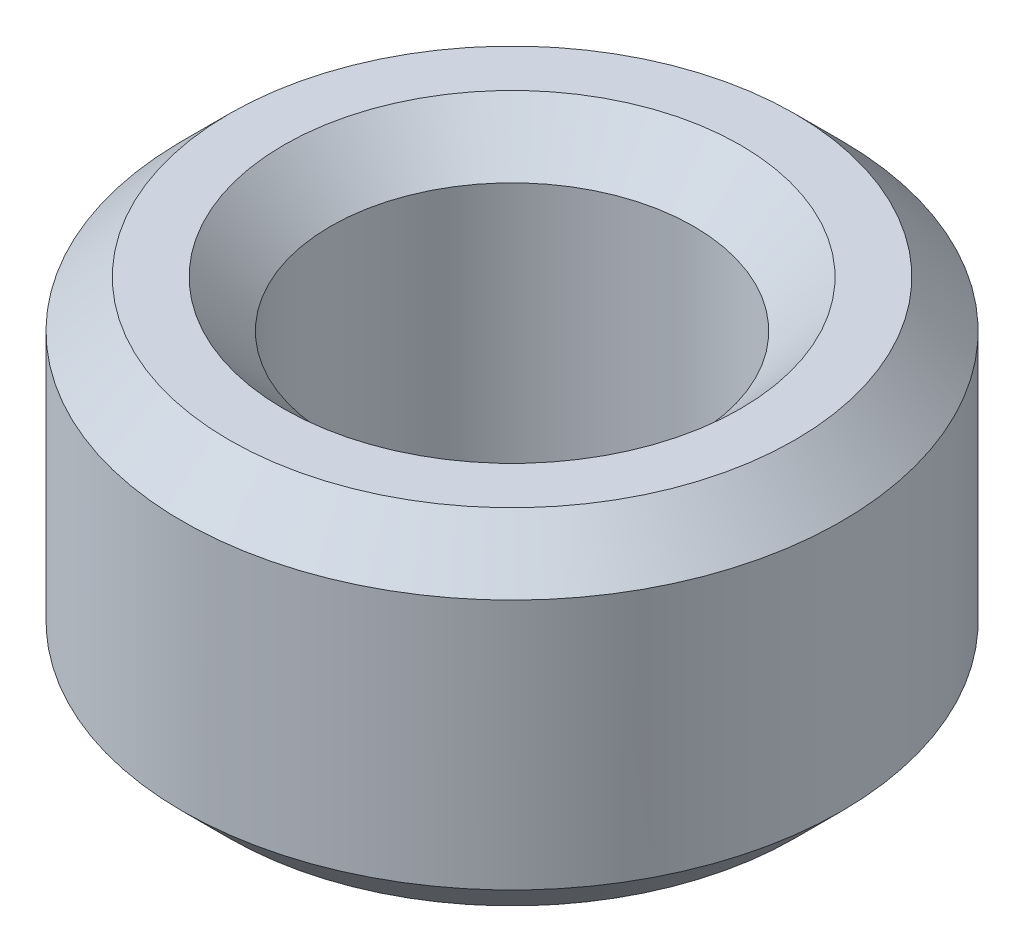
ISO-10303-21;
HEADER;
FILE_DESCRIPTION(('STEP AP214'),'2;1');
FILE_NAME('part.step','',(''),(''),'','','');
FILE_SCHEMA(('AUTOMOTIVE_DESIGN { 1 0 10303 214 1 1 1 1 }'));
ENDSEC;
DATA;
#1=APPLICATION_CONTEXT('core data for automotive mechanical design processes');
#2=APPLICATION_PROTOCOL_DEFINITION('international standard','automotive_design',2000,#1);
#3=PRODUCT_CONTEXT('',#1,'mechanical');
#4=PRODUCT('Part','Part','',(#3));
#5=PRODUCT_RELATED_PRODUCT_CATEGORY('part','',(#4));
#6=PRODUCT_DEFINITION_FORMATION('','',#4);
#7=PRODUCT_DEFINITION_CONTEXT('part definition',#1,'design');
#8=PRODUCT_DEFINITION('design','',#6,#7);
#9=PRODUCT_DEFINITION_SHAPE('','',#8);
#10=(LENGTH_UNIT() NAMED_UNIT(*) SI_UNIT(.MILLI.,.METRE.));
#11=(NAMED_UNIT(*) PLANE_ANGLE_UNIT() SI_UNIT($,.RADIAN.));
#12=(NAMED_UNIT(*) SI_UNIT($,.STERADIAN.) SOLID_ANGLE_UNIT());
#13=UNCERTAINTY_MEASURE_WITH_UNIT(LENGTH_MEASURE(1.E-05),#10,'distance_accuracy_value','');
#14=(GEOMETRIC_REPRESENTATION_CONTEXT(3) GLOBAL_UNCERTAINTY_ASSIGNED_CONTEXT((#13)) GLOBAL_UNIT_ASSIGNED_CONTEXT((#10,
#11,#12)) REPRESENTATION_CONTEXT('',''));
#15=CARTESIAN_POINT('',(0.,0.,0.));
#16=DIRECTION('',(0.,0.,1.));
#17=DIRECTION('',(1.,0.,0.));
#18=AXIS2_PLACEMENT_3D('',#15,#16,#17);
#19=CARTESIAN_POINT('',(0.,13.0782318366644,0.));
#20=DIRECTION('',(0.,-1.,0.));
#21=DIRECTION('',(0.,0.,-1.));
#22=AXIS2_PLACEMENT_3D('',#19,#20,#21);
#23=CYLINDRICAL_SURFACE('',#22,12.5);
#24=CARTESIAN_POINT('',(0.,1.77795092526929,0.));
#25=DIRECTION('',(0.,1.,0.));
#26=DIRECTION('',(0.,0.,1.));
#27=AXIS2_PLACEMENT_3D('',#24,#25,#26);
#28=CIRCLE('',#27,12.5);
#29=CARTESIAN_POINT('',(0.,1.77795092526929,12.5));
#30=VERTEX_POINT('',#29);
#31=EDGE_CURVE('E10',#30,#30,#28,.T.);
#32=ORIENTED_EDGE('',*,*,#31,.T.);
#33=EDGE_LOOP('',(#32));
#34=FACE_BOUND('',#33,.T.);
#35=CARTESIAN_POINT('',(0.,11.3002809113951,0.));
#36=DIRECTION('',(0.,1.,0.));
#37=DIRECTION('',(0.,0.,1.));
#38=AXIS2_PLACEMENT_3D('',#35,#36,#37);
#39=CIRCLE('',#38,12.5);
#40=CARTESIAN_POINT('',(0.,11.3002809113951,-12.5));
#41=VERTEX_POINT('',#40);
#42=EDGE_CURVE('E50',#41,#41,#39,.F.);
#43=ORIENTED_EDGE('',*,*,#42,.T.);
#44=EDGE_LOOP('',(#43));
#45=FACE_BOUND('',#44,.T.);
#46=ADVANCED_FACE('F39',(#34,#45),#23,.T.);
#47=CARTESIAN_POINT('',(0.,13.0782318366644,0.));
#48=DIRECTION('',(0.,1.,0.));
#49=DIRECTION('',(0.,0.,1.));
#50=AXIS2_PLACEMENT_3D('',#47,#48,#49);
#51=PLANE('',#50);
#52=CARTESIAN_POINT('',(0.,13.0782318366644,0.));
#53=DIRECTION('',(0.,1.,0.));
#54=DIRECTION('',(0.,0.,1.));
#55=AXIS2_PLACEMENT_3D('',#52,#53,#54);
#56=CIRCLE('',#55,8.66287953139182);
#57=CARTESIAN_POINT('',(0.,13.0782318366644,8.66287953139182));
#58=VERTEX_POINT('',#57);
#59=EDGE_CURVE('E58',#58,#58,#56,.F.);
#60=ORIENTED_EDGE('',*,*,#59,.T.);
#61=EDGE_LOOP('',(#60));
#62=FACE_BOUND('',#61,.T.);
#63=CARTESIAN_POINT('',(0.,13.0782318366644,0.));
#64=DIRECTION('',(0.,1.,0.));
#65=DIRECTION('',(0.,0.,1.));
#66=AXIS2_PLACEMENT_3D('',#63,#64,#65);
#67=CIRCLE('',#66,10.7220490747307);
#68=CARTESIAN_POINT('',(0.,13.0782318366644,-10.7220490747307));
#69=VERTEX_POINT('',#68);
#70=EDGE_CURVE('E61',#69,#69,#67,.T.);
#71=ORIENTED_EDGE('',*,*,#70,.T.);
#72=EDGE_LOOP('',(#71));
#73=FACE_BOUND('',#72,.T.);
#74=ADVANCED_FACE('F88',(#62,#73),#51,.T.);
#75=CARTESIAN_POINT('',(0.,0.,0.));
#76=DIRECTION('',(0.,1.,0.));
#77=DIRECTION('',(0.,0.,1.));
#78=AXIS2_PLACEMENT_3D('',#75,#76,#77);
#79=PLANE('',#78);
#80=CARTESIAN_POINT('',(0.,0.,0.));
#81=DIRECTION('',(0.,1.,0.));
#82=DIRECTION('',(0.,0.,1.));
#83=AXIS2_PLACEMENT_3D('',#80,#81,#82);
#84=CIRCLE('',#83,8.66287953139182);
#85=CARTESIAN_POINT('',(0.,0.,8.66287953139182));
#86=VERTEX_POINT('',#85);
#87=EDGE_CURVE('E51',#86,#86,#84,.T.);
#88=ORIENTED_EDGE('',*,*,#87,.T.);
#89=EDGE_LOOP('',(#88));
#90=FACE_BOUND('',#89,.T.);
#91=CARTESIAN_POINT('',(0.,0.,0.));
#92=DIRECTION('',(0.,1.,0.));
#93=DIRECTION('',(0.,0.,1.));
#94=AXIS2_PLACEMENT_3D('',#91,#92,#93);
#95=CIRCLE('',#94,10.7220490747307);
#96=CARTESIAN_POINT('',(0.,0.,10.7220490747307));
#97=VERTEX_POINT('',#96);
#98=EDGE_CURVE('E54',#97,#97,#95,.F.);
#99=ORIENTED_EDGE('',*,*,#98,.T.);
#100=EDGE_LOOP('',(#99));
#101=FACE_BOUND('',#100,.T.);
#102=ADVANCED_FACE('F83',(#90,#101),#79,.F.);
#103=CARTESIAN_POINT('',(0.,13.0782318366644,0.));
#104=DIRECTION('',(0.,-1.,0.));
#105=DIRECTION('',(0.,0.,-1.));
#106=AXIS2_PLACEMENT_3D('',#103,#104,#105);
#107=CYLINDRICAL_SURFACE('',#106,6.88492860612252);
#108=CARTESIAN_POINT('',(0.,11.3002809113951,0.));
#109=DIRECTION('',(0.,1.,0.));
#110=DIRECTION('',(0.,0.,1.));
#111=AXIS2_PLACEMENT_3D('',#108,#109,#110);
#112=CIRCLE('',#111,6.88492860612252);
#113=CARTESIAN_POINT('',(0.,11.3002809113951,6.88492860612252));
#114=VERTEX_POINT('',#113);
#115=EDGE_CURVE('E67',#114,#114,#112,.T.);
#116=ORIENTED_EDGE('',*,*,#115,.T.);
#117=EDGE_LOOP('',(#116));
#118=FACE_BOUND('',#117,.T.);
#119=CARTESIAN_POINT('',(0.,1.7779509252693,0.));
#120=DIRECTION('',(0.,1.,0.));
#121=DIRECTION('',(0.,0.,1.));
#122=AXIS2_PLACEMENT_3D('',#119,#120,#121);
#123=CIRCLE('',#122,6.88492860612252);
#124=CARTESIAN_POINT('',(0.,1.7779509252693,6.88492860612252));
#125=VERTEX_POINT('',#124);
#126=EDGE_CURVE('E69',#125,#125,#123,.F.);
#127=ORIENTED_EDGE('',*,*,#126,.T.);
#128=EDGE_LOOP('',(#127));
#129=FACE_BOUND('',#128,.T.);
#130=ADVANCED_FACE('F71',(#118,#129),#107,.F.);
#131=CARTESIAN_POINT('',(0.,11.3002809113951,0.));
#132=DIRECTION('',(0.,1.,0.));
#133=DIRECTION('',(0.,0.,1.));
#134=AXIS2_PLACEMENT_3D('',#131,#132,#133);
#135=CONICAL_SURFACE('',#134,6.88492860612252,0.785398163397451);
#136=ORIENTED_EDGE('',*,*,#59,.F.);
#137=EDGE_LOOP('',(#136));
#138=FACE_BOUND('',#137,.T.);
#139=ORIENTED_EDGE('',*,*,#115,.F.);
#140=EDGE_LOOP('',(#139));
#141=FACE_BOUND('',#140,.T.);
#142=ADVANCED_FACE('F77',(#138,#141),#135,.F.);
#143=CARTESIAN_POINT('',(0.,0.,0.));
#144=DIRECTION('',(0.,-1.,0.));
#145=DIRECTION('',(0.,0.,-1.));
#146=AXIS2_PLACEMENT_3D('',#143,#144,#145);
#147=CONICAL_SURFACE('',#146,8.66287953139182,0.785398163397445);
#148=ORIENTED_EDGE('',*,*,#126,.F.);
#149=EDGE_LOOP('',(#148));
#150=FACE_BOUND('',#149,.T.);
#151=ORIENTED_EDGE('',*,*,#87,.F.);
#152=EDGE_LOOP('',(#151));
#153=FACE_BOUND('',#152,.T.);
#154=ADVANCED_FACE('F73',(#150,#153),#147,.F.);
#155=CARTESIAN_POINT('',(0.,1.77795092526929,0.));
#156=DIRECTION('',(0.,1.,0.));
#157=DIRECTION('',(0.,0.,1.));
#158=AXIS2_PLACEMENT_3D('',#155,#156,#157);
#159=CONICAL_SURFACE('',#158,12.5,0.785398163397452);
#160=ORIENTED_EDGE('',*,*,#98,.F.);
#161=EDGE_LOOP('',(#160));
#162=FACE_BOUND('',#161,.T.);
#163=ORIENTED_EDGE('',*,*,#31,.F.);
#164=EDGE_LOOP('',(#163));
#165=FACE_BOUND('',#164,.T.);
#166=ADVANCED_FACE('F76',(#162,#165),#159,.T.);
#167=CARTESIAN_POINT('',(0.,13.0782318366644,0.));
#168=DIRECTION('',(0.,-1.,0.));
#169=DIRECTION('',(0.,0.,-1.));
#170=AXIS2_PLACEMENT_3D('',#167,#168,#169);
#171=CONICAL_SURFACE('',#170,10.7220490747307,0.785398163397443);
#172=CARTESIAN_POINT('',(0.,11.3002809113951,-12.5));
#173=CARTESIAN_POINT('',(0.,11.3188012335333,-12.4814796778618));
#174=CARTESIAN_POINT('',(0.,11.3373215556715,-12.4629593557236));
#175=CARTESIAN_POINT('',(0.,11.374362199948,-12.4259187114471));
#176=CARTESIAN_POINT('',(0.,11.3928825220862,-12.4073983893089));
#177=CARTESIAN_POINT('',(0.,11.4299231663627,-12.3703577450325));
#178=CARTESIAN_POINT('',(0.,11.4484434885009,-12.3518374228942));
#179=CARTESIAN_POINT('',(0.,11.4854841327773,-12.3147967786178));
#180=CARTESIAN_POINT('',(0.,11.5040044549155,-12.2962764564796));
#181=CARTESIAN_POINT('',(0.,11.541045099192,-12.2592358122031));
#182=CARTESIAN_POINT('',(0.,11.5595654213302,-12.2407154900649));
#183=CARTESIAN_POINT('',(0.,11.5966060656067,-12.2036748457885));
#184=CARTESIAN_POINT('',(0.,11.6151263877449,-12.1851545236502));
#185=CARTESIAN_POINT('',(0.,11.6521670320213,-12.1481138793738));
#186=CARTESIAN_POINT('',(0.,11.6706873541595,-12.1295935572356));
#187=CARTESIAN_POINT('',(0.,11.707727998436,-12.0925529129591));
#188=CARTESIAN_POINT('',(0.,11.7262483205742,-12.0740325908209));
#189=CARTESIAN_POINT('',(0.,11.7632889648506,-12.0369919465445));
#190=CARTESIAN_POINT('',(0.,11.7818092869889,-12.0184716244062));
#191=CARTESIAN_POINT('',(0.,11.8188499312653,-11.9814309801298));
#192=CARTESIAN_POINT('',(0.,11.8373702534035,-11.9629106579916));
#193=CARTESIAN_POINT('',(0.,11.87441089768,-11.9258700137151));
#194=CARTESIAN_POINT('',(0.,11.8929312198182,-11.9073496915769));
#195=CARTESIAN_POINT('',(0.,11.9299718640946,-11.8703090473005));
#196=CARTESIAN_POINT('',(0.,11.9484921862329,-11.8517887251622));
#197=CARTESIAN_POINT('',(0.,11.9855328305093,-11.8147480808858));
#198=CARTESIAN_POINT('',(0.,12.0040531526475,-11.7962277587476));
#199=CARTESIAN_POINT('',(0.,12.041093796924,-11.7591871144711));
#200=CARTESIAN_POINT('',(0.,12.0596141190622,-11.7406667923329));
#201=CARTESIAN_POINT('',(0.,12.0966547633386,-11.7036261480565));
#202=CARTESIAN_POINT('',(0.,12.1151750854769,-11.6851058259182));
#203=CARTESIAN_POINT('',(0.,12.1522157297533,-11.6480651816418));
#204=CARTESIAN_POINT('',(0.,12.1707360518915,-11.6295448595036));
#205=CARTESIAN_POINT('',(0.,12.207776696168,-11.5925042152271));
#206=CARTESIAN_POINT('',(0.,12.2262970183062,-11.5739838930889));
#207=CARTESIAN_POINT('',(0.,12.2633376625826,-11.5369432488125));
#208=CARTESIAN_POINT('',(0.,12.2818579847209,-11.5184229266743));
#209=CARTESIAN_POINT('',(0.,12.3188986289973,-11.4813822823978));
#210=CARTESIAN_POINT('',(0.,12.3374189511355,-11.4628619602596));
#211=CARTESIAN_POINT('',(0.,12.374459595412,-11.4258213159831));
#212=CARTESIAN_POINT('',(0.,12.3929799175502,-11.4073009938449));
#213=CARTESIAN_POINT('',(0.,12.4300205618266,-11.3702603495685));
#214=CARTESIAN_POINT('',(0.,12.4485408839649,-11.3517400274303));
#215=CARTESIAN_POINT('',(0.,12.4855815282413,-11.3146993831538));
#216=CARTESIAN_POINT('',(0.,12.5041018503795,-11.2961790610156));
#217=CARTESIAN_POINT('',(0.,12.541142494656,-11.2591384167391));
#218=CARTESIAN_POINT('',(0.,12.5596628167942,-11.2406180946009));
#219=CARTESIAN_POINT('',(0.,12.5967034610706,-11.2035774503245));
#220=CARTESIAN_POINT('',(0.,12.6152237832089,-11.1850571281863));
#221=CARTESIAN_POINT('',(0.,12.6522644274853,-11.1480164839098));
#222=CARTESIAN_POINT('',(0.,12.6707847496235,-11.1294961617716));
#223=CARTESIAN_POINT('',(0.,12.7078253939,-11.0924555174952));
#224=CARTESIAN_POINT('',(0.,12.7263457160382,-11.0739351953569));
#225=CARTESIAN_POINT('',(0.,12.7633863603146,-11.0368945510805));
#226=CARTESIAN_POINT('',(0.,12.7819066824529,-11.0183742289423));
#227=CARTESIAN_POINT('',(0.,12.8189473267293,-10.9813335846658));
#228=CARTESIAN_POINT('',(0.,12.8374676488675,-10.9628132625276));
#229=CARTESIAN_POINT('',(0.,12.874508293144,-10.9257726182512));
#230=CARTESIAN_POINT('',(0.,12.8930286152822,-10.9072522961129));
#231=CARTESIAN_POINT('',(0.,12.9300692595586,-10.8702116518365));
#232=CARTESIAN_POINT('',(0.,12.9485895816969,-10.8516913296983));
#233=CARTESIAN_POINT('',(0.,12.9856302259733,-10.8146506854218));
#234=CARTESIAN_POINT('',(0.,13.0041505481115,-10.7961303632836));
#235=CARTESIAN_POINT('',(0.,13.041191192388,-10.7590897190072));
#236=CARTESIAN_POINT('',(0.,13.0597115145262,-10.7405693968689));
#237=CARTESIAN_POINT('',(0.,13.0782318366644,-10.7220490747307));
#238=B_SPLINE_CURVE_WITH_KNOTS('',3,(#172,#173,#174,#175,#176,#177,#178,#179,#180,#181,#182,
#183,#184,#185,#186,#187,#188,#189,#190,#191,#192,#193,#194,#195,#196,#197,#198,#199,#200,#201,
#202,#203,#204,#205,#206,#207,#208,#209,#210,#211,#212,#213,#214,#215,#216,#217,#218,#219,#220,
#221,#222,#223,#224,#225,#226,#227,#228,#229,#230,#231,#232,#233,#234,#235,#236,#237),
.UNSPECIFIED.,.F.,.F.,(4,2,2,2,2,2,2,2,2,2,2,2,2,2,2,2,2,2,2,2,2,2,2,2,2,2,2,2,2,2,2,2,4),(0.,
0.0785750722421764,0.157150144484352,0.235725216726528,0.314300288968704,0.392875361210881,
0.471450433453056,0.550025505695233,0.628600577937408,0.707175650179583,0.785750722421759,
0.864325794663935,0.942900866906111,1.02147593914829,1.10005101139046,1.17862608363264,
1.25720115587481,1.33577622811699,1.41435130035916,1.49292637260134,1.57150144484352,
1.65007651708569,1.72865158932787,1.80722666157005,1.88580173381222,1.9643768060544,
2.04295187829657,2.12152695053875,2.20010202278092,2.2786770950231,2.35725216726528,
2.43582723950745,2.51440231174963),.UNSPECIFIED.);
#239=EDGE_CURVE('BSEAM45',#41,#69,#238,.T.);
#240=ORIENTED_EDGE('',*,*,#42,.F.);
#241=ORIENTED_EDGE('',*,*,#70,.F.);
#242=ORIENTED_EDGE('',*,*,#239,.T.);
#243=ORIENTED_EDGE('',*,*,#239,.F.);
#244=EDGE_LOOP('',(#240,#242,#241,#243));
#245=FACE_BOUND('',#244,.T.);
#246=ADVANCED_FACE('F45',(#245),#171,.T.);
#247=CLOSED_SHELL('',(#46,#74,#102,#130,#142,#154,#166,#246));
#248=MANIFOLD_SOLID_BREP('B2',#247);
#249=ADVANCED_BREP_SHAPE_REPRESENTATION('',(#18,#248),#14);
#250=SHAPE_DEFINITION_REPRESENTATION(#9,#249);
ENDSEC;
END-ISO-10303-21;
